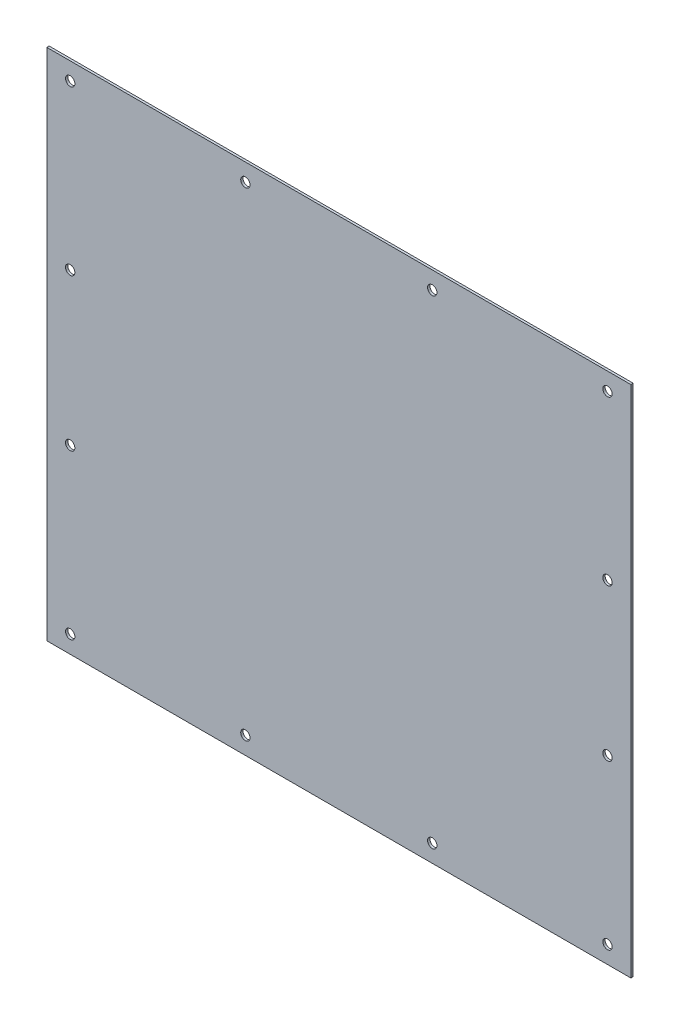
ISO-10303-21;
HEADER;
FILE_DESCRIPTION(('STEP AP214'),'2;1');
FILE_NAME('part.step','',(''),(''),'','','');
FILE_SCHEMA(('AUTOMOTIVE_DESIGN { 1 0 10303 214 1 1 1 1 }'));
ENDSEC;
DATA;
#1=APPLICATION_CONTEXT('core data for automotive mechanical design processes');
#2=APPLICATION_PROTOCOL_DEFINITION('international standard','automotive_design',2000,#1);
#3=PRODUCT_CONTEXT('',#1,'mechanical');
#4=PRODUCT('Part','Part','',(#3));
#5=PRODUCT_RELATED_PRODUCT_CATEGORY('part','',(#4));
#6=PRODUCT_DEFINITION_FORMATION('','',#4);
#7=PRODUCT_DEFINITION_CONTEXT('part definition',#1,'design');
#8=PRODUCT_DEFINITION('design','',#6,#7);
#9=PRODUCT_DEFINITION_SHAPE('','',#8);
#10=(LENGTH_UNIT() NAMED_UNIT(*) SI_UNIT(.MILLI.,.METRE.));
#11=(NAMED_UNIT(*) PLANE_ANGLE_UNIT() SI_UNIT($,.RADIAN.));
#12=(NAMED_UNIT(*) SI_UNIT($,.STERADIAN.) SOLID_ANGLE_UNIT());
#13=UNCERTAINTY_MEASURE_WITH_UNIT(LENGTH_MEASURE(1.E-05),#10,'distance_accuracy_value','');
#14=(GEOMETRIC_REPRESENTATION_CONTEXT(3) GLOBAL_UNCERTAINTY_ASSIGNED_CONTEXT((#13)) GLOBAL_UNIT_ASSIGNED_CONTEXT((#10,
#11,#12)) REPRESENTATION_CONTEXT('',''));
#15=CARTESIAN_POINT('',(0.,0.,0.));
#16=DIRECTION('',(0.,0.,1.));
#17=DIRECTION('',(1.,0.,0.));
#18=AXIS2_PLACEMENT_3D('',#15,#16,#17);
#19=CARTESIAN_POINT('',(-250.,0.,2.));
#20=DIRECTION('',(1.,0.,0.));
#21=DIRECTION('',(0.,1.,0.));
#22=AXIS2_PLACEMENT_3D('',#19,#20,#21);
#23=PLANE('',#22);
#24=DIRECTION('',(0.,-1.,0.));
#25=VECTOR('',#24,1.);
#26=CARTESIAN_POINT('',(-250.,0.,0.));
#27=LINE('',#26,#25);
#28=CARTESIAN_POINT('',(-250.,0.,0.));
#29=VERTEX_POINT('',#28);
#30=CARTESIAN_POINT('',(-250.,-440.,0.));
#31=VERTEX_POINT('',#30);
#32=EDGE_CURVE('E98',#29,#31,#27,.T.);
#33=ORIENTED_EDGE('',*,*,#32,.T.);
#34=DIRECTION('',(0.,0.,-1.));
#35=VECTOR('',#34,1.);
#36=CARTESIAN_POINT('',(-250.,-440.,2.));
#37=LINE('',#36,#35);
#38=CARTESIAN_POINT('',(-250.,-440.,2.));
#39=VERTEX_POINT('',#38);
#40=EDGE_CURVE('E11',#39,#31,#37,.T.);
#41=ORIENTED_EDGE('',*,*,#40,.F.);
#42=DIRECTION('',(0.,-1.,0.));
#43=VECTOR('',#42,1.);
#44=CARTESIAN_POINT('',(-250.,0.,2.));
#45=LINE('',#44,#43);
#46=CARTESIAN_POINT('',(-250.,0.,2.));
#47=VERTEX_POINT('',#46);
#48=EDGE_CURVE('E86',#47,#39,#45,.T.);
#49=ORIENTED_EDGE('',*,*,#48,.F.);
#50=DIRECTION('',(0.,0.,-1.));
#51=VECTOR('',#50,1.);
#52=CARTESIAN_POINT('',(-250.,0.,2.));
#53=LINE('',#52,#51);
#54=EDGE_CURVE('E94',#47,#29,#53,.T.);
#55=ORIENTED_EDGE('',*,*,#54,.T.);
#56=EDGE_LOOP('',(#33,#41,#49,#55));
#57=FACE_BOUND('',#56,.T.);
#58=ADVANCED_FACE('F35',(#57),#23,.F.);
#59=CARTESIAN_POINT('',(-250.,-440.,2.));
#60=DIRECTION('',(0.,1.,0.));
#61=DIRECTION('',(0.,0.,1.));
#62=AXIS2_PLACEMENT_3D('',#59,#60,#61);
#63=PLANE('',#62);
#64=DIRECTION('',(1.,0.,0.));
#65=VECTOR('',#64,1.);
#66=CARTESIAN_POINT('',(-250.,-440.,0.));
#67=LINE('',#66,#65);
#68=CARTESIAN_POINT('',(250.,-440.,0.));
#69=VERTEX_POINT('',#68);
#70=EDGE_CURVE('E90',#31,#69,#67,.T.);
#71=ORIENTED_EDGE('',*,*,#70,.T.);
#72=DIRECTION('',(0.,0.,-1.));
#73=VECTOR('',#72,1.);
#74=CARTESIAN_POINT('',(250.,-440.,2.));
#75=LINE('',#74,#73);
#76=CARTESIAN_POINT('',(250.,-440.,2.));
#77=VERTEX_POINT('',#76);
#78=EDGE_CURVE('E43',#77,#69,#75,.T.);
#79=ORIENTED_EDGE('',*,*,#78,.F.);
#80=DIRECTION('',(1.,0.,0.));
#81=VECTOR('',#80,1.);
#82=CARTESIAN_POINT('',(-250.,-440.,2.));
#83=LINE('',#82,#81);
#84=EDGE_CURVE('E81',#39,#77,#83,.T.);
#85=ORIENTED_EDGE('',*,*,#84,.F.);
#86=ORIENTED_EDGE('',*,*,#40,.T.);
#87=EDGE_LOOP('',(#71,#79,#85,#86));
#88=FACE_BOUND('',#87,.T.);
#89=ADVANCED_FACE('F89',(#88),#63,.F.);
#90=CARTESIAN_POINT('',(250.,0.,2.));
#91=DIRECTION('',(-1.,0.,0.));
#92=DIRECTION('',(0.,-1.,0.));
#93=AXIS2_PLACEMENT_3D('',#90,#91,#92);
#94=PLANE('',#93);
#95=DIRECTION('',(0.,1.,0.));
#96=VECTOR('',#95,1.);
#97=CARTESIAN_POINT('',(250.,0.,0.));
#98=LINE('',#97,#96);
#99=CARTESIAN_POINT('',(250.,0.,0.));
#100=VERTEX_POINT('',#99);
#101=EDGE_CURVE('E68',#69,#100,#98,.T.);
#102=ORIENTED_EDGE('',*,*,#101,.T.);
#103=DIRECTION('',(0.,0.,-1.));
#104=VECTOR('',#103,1.);
#105=CARTESIAN_POINT('',(250.,0.,2.));
#106=LINE('',#105,#104);
#107=CARTESIAN_POINT('',(250.,0.,2.));
#108=VERTEX_POINT('',#107);
#109=EDGE_CURVE('E91',#108,#100,#106,.T.);
#110=ORIENTED_EDGE('',*,*,#109,.F.);
#111=DIRECTION('',(0.,1.,0.));
#112=VECTOR('',#111,1.);
#113=CARTESIAN_POINT('',(250.,0.,2.));
#114=LINE('',#113,#112);
#115=EDGE_CURVE('E84',#77,#108,#114,.T.);
#116=ORIENTED_EDGE('',*,*,#115,.F.);
#117=ORIENTED_EDGE('',*,*,#78,.T.);
#118=EDGE_LOOP('',(#102,#110,#116,#117));
#119=FACE_BOUND('',#118,.T.);
#120=ADVANCED_FACE('F92',(#119),#94,.F.);
#121=CARTESIAN_POINT('',(-250.,0.,2.));
#122=DIRECTION('',(0.,-1.,0.));
#123=DIRECTION('',(0.,0.,-1.));
#124=AXIS2_PLACEMENT_3D('',#121,#122,#123);
#125=PLANE('',#124);
#126=DIRECTION('',(-1.,0.,0.));
#127=VECTOR('',#126,1.);
#128=CARTESIAN_POINT('',(-250.,0.,0.));
#129=LINE('',#128,#127);
#130=EDGE_CURVE('E74',#100,#29,#129,.T.);
#131=ORIENTED_EDGE('',*,*,#130,.T.);
#132=ORIENTED_EDGE('',*,*,#54,.F.);
#133=DIRECTION('',(-1.,0.,0.));
#134=VECTOR('',#133,1.);
#135=CARTESIAN_POINT('',(-250.,0.,2.));
#136=LINE('',#135,#134);
#137=EDGE_CURVE('E51',#108,#47,#136,.T.);
#138=ORIENTED_EDGE('',*,*,#137,.F.);
#139=ORIENTED_EDGE('',*,*,#109,.T.);
#140=EDGE_LOOP('',(#131,#132,#138,#139));
#141=FACE_BOUND('',#140,.T.);
#142=ADVANCED_FACE('F106',(#141),#125,.F.);
#143=CARTESIAN_POINT('',(0.,0.,2.));
#144=DIRECTION('',(0.,0.,1.));
#145=DIRECTION('',(1.,0.,0.));
#146=AXIS2_PLACEMENT_3D('',#143,#144,#145);
#147=PLANE('',#146);
#148=CARTESIAN_POINT('',(-230.,-425.,2.));
#149=DIRECTION('',(0.,0.,1.));
#150=DIRECTION('',(1.,0.,0.));
#151=AXIS2_PLACEMENT_3D('',#148,#149,#150);
#152=CIRCLE('',#151,4.00000000000002);
#153=CARTESIAN_POINT('',(-226.,-425.,2.));
#154=VERTEX_POINT('',#153);
#155=EDGE_CURVE('E177',#154,#154,#152,.T.);
#156=ORIENTED_EDGE('',*,*,#155,.F.);
#157=EDGE_LOOP('',(#156));
#158=FACE_BOUND('',#157,.T.);
#159=CARTESIAN_POINT('',(230.,-155.,2.));
#160=DIRECTION('',(0.,0.,1.));
#161=DIRECTION('',(1.,0.,0.));
#162=AXIS2_PLACEMENT_3D('',#159,#160,#161);
#163=CIRCLE('',#162,3.99999999999999);
#164=CARTESIAN_POINT('',(234.,-155.,2.));
#165=VERTEX_POINT('',#164);
#166=EDGE_CURVE('E171',#165,#165,#163,.T.);
#167=ORIENTED_EDGE('',*,*,#166,.F.);
#168=EDGE_LOOP('',(#167));
#169=FACE_BOUND('',#168,.T.);
#170=CARTESIAN_POINT('',(230.,-285.,2.));
#171=DIRECTION('',(0.,0.,1.));
#172=DIRECTION('',(1.,0.,0.));
#173=AXIS2_PLACEMENT_3D('',#170,#171,#172);
#174=CIRCLE('',#173,3.99999999999999);
#175=CARTESIAN_POINT('',(234.,-285.,2.));
#176=VERTEX_POINT('',#175);
#177=EDGE_CURVE('E165',#176,#176,#174,.T.);
#178=ORIENTED_EDGE('',*,*,#177,.F.);
#179=EDGE_LOOP('',(#178));
#180=FACE_BOUND('',#179,.T.);
#181=CARTESIAN_POINT('',(230.,-425.,2.));
#182=DIRECTION('',(0.,0.,1.));
#183=DIRECTION('',(1.,0.,0.));
#184=AXIS2_PLACEMENT_3D('',#181,#182,#183);
#185=CIRCLE('',#184,3.99999999999999);
#186=CARTESIAN_POINT('',(234.,-425.,2.));
#187=VERTEX_POINT('',#186);
#188=EDGE_CURVE('E159',#187,#187,#185,.T.);
#189=ORIENTED_EDGE('',*,*,#188,.F.);
#190=EDGE_LOOP('',(#189));
#191=FACE_BOUND('',#190,.T.);
#192=CARTESIAN_POINT('',(79.9999999999999,-425.,2.));
#193=DIRECTION('',(0.,0.,1.));
#194=DIRECTION('',(1.,0.,0.));
#195=AXIS2_PLACEMENT_3D('',#192,#193,#194);
#196=CIRCLE('',#195,4.00000000000001);
#197=CARTESIAN_POINT('',(83.9999999999999,-425.,2.));
#198=VERTEX_POINT('',#197);
#199=EDGE_CURVE('E153',#198,#198,#196,.T.);
#200=ORIENTED_EDGE('',*,*,#199,.F.);
#201=EDGE_LOOP('',(#200));
#202=FACE_BOUND('',#201,.T.);
#203=CARTESIAN_POINT('',(-80.0000000000001,-425.,2.));
#204=DIRECTION('',(0.,0.,1.));
#205=DIRECTION('',(1.,0.,0.));
#206=AXIS2_PLACEMENT_3D('',#203,#204,#205);
#207=CIRCLE('',#206,4.00000000000001);
#208=CARTESIAN_POINT('',(-76.0000000000001,-425.,2.));
#209=VERTEX_POINT('',#208);
#210=EDGE_CURVE('E147',#209,#209,#207,.T.);
#211=ORIENTED_EDGE('',*,*,#210,.F.);
#212=EDGE_LOOP('',(#211));
#213=FACE_BOUND('',#212,.T.);
#214=CARTESIAN_POINT('',(-230.,-285.,2.));
#215=DIRECTION('',(0.,0.,1.));
#216=DIRECTION('',(1.,0.,0.));
#217=AXIS2_PLACEMENT_3D('',#214,#215,#216);
#218=CIRCLE('',#217,3.99999999999999);
#219=CARTESIAN_POINT('',(-226.,-285.,2.));
#220=VERTEX_POINT('',#219);
#221=EDGE_CURVE('E141',#220,#220,#218,.T.);
#222=ORIENTED_EDGE('',*,*,#221,.F.);
#223=EDGE_LOOP('',(#222));
#224=FACE_BOUND('',#223,.T.);
#225=CARTESIAN_POINT('',(-230.,-155.,2.));
#226=DIRECTION('',(0.,0.,1.));
#227=DIRECTION('',(1.,0.,0.));
#228=AXIS2_PLACEMENT_3D('',#225,#226,#227);
#229=CIRCLE('',#228,4.00000000000002);
#230=CARTESIAN_POINT('',(-226.,-155.,2.));
#231=VERTEX_POINT('',#230);
#232=EDGE_CURVE('E135',#231,#231,#229,.T.);
#233=ORIENTED_EDGE('',*,*,#232,.F.);
#234=EDGE_LOOP('',(#233));
#235=FACE_BOUND('',#234,.T.);
#236=CARTESIAN_POINT('',(-230.,-15.,2.));
#237=DIRECTION('',(0.,0.,1.));
#238=DIRECTION('',(1.,0.,0.));
#239=AXIS2_PLACEMENT_3D('',#236,#237,#238);
#240=CIRCLE('',#239,3.99999999999999);
#241=CARTESIAN_POINT('',(-226.,-15.,2.));
#242=VERTEX_POINT('',#241);
#243=EDGE_CURVE('E129',#242,#242,#240,.T.);
#244=ORIENTED_EDGE('',*,*,#243,.F.);
#245=EDGE_LOOP('',(#244));
#246=FACE_BOUND('',#245,.T.);
#247=CARTESIAN_POINT('',(-80.,-15.,2.));
#248=DIRECTION('',(0.,0.,1.));
#249=DIRECTION('',(1.,0.,0.));
#250=AXIS2_PLACEMENT_3D('',#247,#248,#249);
#251=CIRCLE('',#250,4.00000000000001);
#252=CARTESIAN_POINT('',(-76.,-15.,2.));
#253=VERTEX_POINT('',#252);
#254=EDGE_CURVE('E123',#253,#253,#251,.T.);
#255=ORIENTED_EDGE('',*,*,#254,.F.);
#256=EDGE_LOOP('',(#255));
#257=FACE_BOUND('',#256,.T.);
#258=CARTESIAN_POINT('',(80.,-15.,2.));
#259=DIRECTION('',(0.,0.,1.));
#260=DIRECTION('',(1.,0.,0.));
#261=AXIS2_PLACEMENT_3D('',#258,#259,#260);
#262=CIRCLE('',#261,4.00000000000001);
#263=CARTESIAN_POINT('',(84.,-15.,2.));
#264=VERTEX_POINT('',#263);
#265=EDGE_CURVE('E117',#264,#264,#262,.T.);
#266=ORIENTED_EDGE('',*,*,#265,.F.);
#267=EDGE_LOOP('',(#266));
#268=FACE_BOUND('',#267,.T.);
#269=CARTESIAN_POINT('',(230.,-15.,2.));
#270=DIRECTION('',(0.,0.,1.));
#271=DIRECTION('',(1.,0.,0.));
#272=AXIS2_PLACEMENT_3D('',#269,#270,#271);
#273=CIRCLE('',#272,3.99999999999999);
#274=CARTESIAN_POINT('',(234.,-15.,2.));
#275=VERTEX_POINT('',#274);
#276=EDGE_CURVE('E101',#275,#275,#273,.T.);
#277=ORIENTED_EDGE('',*,*,#276,.F.);
#278=EDGE_LOOP('',(#277));
#279=FACE_BOUND('',#278,.T.);
#280=ORIENTED_EDGE('',*,*,#48,.T.);
#281=ORIENTED_EDGE('',*,*,#84,.T.);
#282=ORIENTED_EDGE('',*,*,#115,.T.);
#283=ORIENTED_EDGE('',*,*,#137,.T.);
#284=EDGE_LOOP('',(#280,#281,#282,#283));
#285=FACE_BOUND('',#284,.T.);
#286=ADVANCED_FACE('F82',(#158,#169,#180,#191,#202,#213,#224,#235,#246,#257,#268,#279,#285),
#147,.T.);
#287=CARTESIAN_POINT('',(0.,0.,0.));
#288=DIRECTION('',(0.,0.,1.));
#289=DIRECTION('',(1.,0.,0.));
#290=AXIS2_PLACEMENT_3D('',#287,#288,#289);
#291=PLANE('',#290);
#292=CARTESIAN_POINT('',(-230.,-425.,0.));
#293=DIRECTION('',(0.,0.,-1.));
#294=DIRECTION('',(-1.,0.,0.));
#295=AXIS2_PLACEMENT_3D('',#292,#293,#294);
#296=CIRCLE('',#295,4.00000000000002);
#297=CARTESIAN_POINT('',(-234.,-425.,0.));
#298=VERTEX_POINT('',#297);
#299=EDGE_CURVE('E180',#298,#298,#296,.T.);
#300=ORIENTED_EDGE('',*,*,#299,.F.);
#301=EDGE_LOOP('',(#300));
#302=FACE_BOUND('',#301,.T.);
#303=CARTESIAN_POINT('',(230.,-155.,0.));
#304=DIRECTION('',(0.,0.,-1.));
#305=DIRECTION('',(-1.,0.,0.));
#306=AXIS2_PLACEMENT_3D('',#303,#304,#305);
#307=CIRCLE('',#306,3.99999999999999);
#308=CARTESIAN_POINT('',(226.,-155.,0.));
#309=VERTEX_POINT('',#308);
#310=EDGE_CURVE('E174',#309,#309,#307,.T.);
#311=ORIENTED_EDGE('',*,*,#310,.F.);
#312=EDGE_LOOP('',(#311));
#313=FACE_BOUND('',#312,.T.);
#314=CARTESIAN_POINT('',(230.,-285.,0.));
#315=DIRECTION('',(0.,0.,-1.));
#316=DIRECTION('',(-1.,0.,0.));
#317=AXIS2_PLACEMENT_3D('',#314,#315,#316);
#318=CIRCLE('',#317,3.99999999999999);
#319=CARTESIAN_POINT('',(226.,-285.,0.));
#320=VERTEX_POINT('',#319);
#321=EDGE_CURVE('E168',#320,#320,#318,.T.);
#322=ORIENTED_EDGE('',*,*,#321,.F.);
#323=EDGE_LOOP('',(#322));
#324=FACE_BOUND('',#323,.T.);
#325=CARTESIAN_POINT('',(230.,-425.,0.));
#326=DIRECTION('',(0.,0.,-1.));
#327=DIRECTION('',(-1.,0.,0.));
#328=AXIS2_PLACEMENT_3D('',#325,#326,#327);
#329=CIRCLE('',#328,3.99999999999999);
#330=CARTESIAN_POINT('',(226.,-425.,0.));
#331=VERTEX_POINT('',#330);
#332=EDGE_CURVE('E162',#331,#331,#329,.T.);
#333=ORIENTED_EDGE('',*,*,#332,.F.);
#334=EDGE_LOOP('',(#333));
#335=FACE_BOUND('',#334,.T.);
#336=CARTESIAN_POINT('',(79.9999999999999,-425.,0.));
#337=DIRECTION('',(0.,0.,-1.));
#338=DIRECTION('',(-1.,0.,0.));
#339=AXIS2_PLACEMENT_3D('',#336,#337,#338);
#340=CIRCLE('',#339,4.00000000000001);
#341=CARTESIAN_POINT('',(75.9999999999999,-425.,0.));
#342=VERTEX_POINT('',#341);
#343=EDGE_CURVE('E156',#342,#342,#340,.T.);
#344=ORIENTED_EDGE('',*,*,#343,.F.);
#345=EDGE_LOOP('',(#344));
#346=FACE_BOUND('',#345,.T.);
#347=CARTESIAN_POINT('',(-80.0000000000001,-425.,0.));
#348=DIRECTION('',(0.,0.,-1.));
#349=DIRECTION('',(-1.,0.,0.));
#350=AXIS2_PLACEMENT_3D('',#347,#348,#349);
#351=CIRCLE('',#350,4.00000000000001);
#352=CARTESIAN_POINT('',(-84.0000000000001,-425.,0.));
#353=VERTEX_POINT('',#352);
#354=EDGE_CURVE('E150',#353,#353,#351,.T.);
#355=ORIENTED_EDGE('',*,*,#354,.F.);
#356=EDGE_LOOP('',(#355));
#357=FACE_BOUND('',#356,.T.);
#358=CARTESIAN_POINT('',(-230.,-285.,0.));
#359=DIRECTION('',(0.,0.,-1.));
#360=DIRECTION('',(-1.,0.,0.));
#361=AXIS2_PLACEMENT_3D('',#358,#359,#360);
#362=CIRCLE('',#361,3.99999999999999);
#363=CARTESIAN_POINT('',(-234.,-285.,0.));
#364=VERTEX_POINT('',#363);
#365=EDGE_CURVE('E144',#364,#364,#362,.T.);
#366=ORIENTED_EDGE('',*,*,#365,.F.);
#367=EDGE_LOOP('',(#366));
#368=FACE_BOUND('',#367,.T.);
#369=CARTESIAN_POINT('',(-230.,-155.,0.));
#370=DIRECTION('',(0.,0.,-1.));
#371=DIRECTION('',(-1.,0.,0.));
#372=AXIS2_PLACEMENT_3D('',#369,#370,#371);
#373=CIRCLE('',#372,4.00000000000002);
#374=CARTESIAN_POINT('',(-234.,-155.,0.));
#375=VERTEX_POINT('',#374);
#376=EDGE_CURVE('E138',#375,#375,#373,.T.);
#377=ORIENTED_EDGE('',*,*,#376,.F.);
#378=EDGE_LOOP('',(#377));
#379=FACE_BOUND('',#378,.T.);
#380=CARTESIAN_POINT('',(-230.,-15.,0.));
#381=DIRECTION('',(0.,0.,-1.));
#382=DIRECTION('',(-1.,0.,0.));
#383=AXIS2_PLACEMENT_3D('',#380,#381,#382);
#384=CIRCLE('',#383,3.99999999999999);
#385=CARTESIAN_POINT('',(-234.,-15.,0.));
#386=VERTEX_POINT('',#385);
#387=EDGE_CURVE('E132',#386,#386,#384,.T.);
#388=ORIENTED_EDGE('',*,*,#387,.F.);
#389=EDGE_LOOP('',(#388));
#390=FACE_BOUND('',#389,.T.);
#391=CARTESIAN_POINT('',(-80.,-15.,0.));
#392=DIRECTION('',(0.,0.,-1.));
#393=DIRECTION('',(-1.,0.,0.));
#394=AXIS2_PLACEMENT_3D('',#391,#392,#393);
#395=CIRCLE('',#394,4.00000000000001);
#396=CARTESIAN_POINT('',(-84.,-15.,0.));
#397=VERTEX_POINT('',#396);
#398=EDGE_CURVE('E126',#397,#397,#395,.T.);
#399=ORIENTED_EDGE('',*,*,#398,.F.);
#400=EDGE_LOOP('',(#399));
#401=FACE_BOUND('',#400,.T.);
#402=CARTESIAN_POINT('',(80.,-15.,0.));
#403=DIRECTION('',(0.,0.,-1.));
#404=DIRECTION('',(-1.,0.,0.));
#405=AXIS2_PLACEMENT_3D('',#402,#403,#404);
#406=CIRCLE('',#405,4.00000000000001);
#407=CARTESIAN_POINT('',(76.,-15.,0.));
#408=VERTEX_POINT('',#407);
#409=EDGE_CURVE('E120',#408,#408,#406,.T.);
#410=ORIENTED_EDGE('',*,*,#409,.F.);
#411=EDGE_LOOP('',(#410));
#412=FACE_BOUND('',#411,.T.);
#413=CARTESIAN_POINT('',(230.,-15.,0.));
#414=DIRECTION('',(0.,0.,-1.));
#415=DIRECTION('',(-1.,0.,0.));
#416=AXIS2_PLACEMENT_3D('',#413,#414,#415);
#417=CIRCLE('',#416,3.99999999999999);
#418=CARTESIAN_POINT('',(226.,-15.,0.));
#419=VERTEX_POINT('',#418);
#420=EDGE_CURVE('E114',#419,#419,#417,.T.);
#421=ORIENTED_EDGE('',*,*,#420,.F.);
#422=EDGE_LOOP('',(#421));
#423=FACE_BOUND('',#422,.T.);
#424=ORIENTED_EDGE('',*,*,#32,.F.);
#425=ORIENTED_EDGE('',*,*,#130,.F.);
#426=ORIENTED_EDGE('',*,*,#101,.F.);
#427=ORIENTED_EDGE('',*,*,#70,.F.);
#428=EDGE_LOOP('',(#424,#425,#426,#427));
#429=FACE_BOUND('',#428,.T.);
#430=ADVANCED_FACE('F109',(#302,#313,#324,#335,#346,#357,#368,#379,#390,#401,#412,#423,#429),
#291,.F.);
#431=CARTESIAN_POINT('',(230.,-15.,10.));
#432=DIRECTION('',(0.,0.,-1.));
#433=DIRECTION('',(-1.,0.,0.));
#434=AXIS2_PLACEMENT_3D('',#431,#432,#433);
#435=CYLINDRICAL_SURFACE('',#434,3.99999999999999);
#436=ORIENTED_EDGE('',*,*,#276,.T.);
#437=EDGE_LOOP('',(#436));
#438=FACE_BOUND('',#437,.T.);
#439=ORIENTED_EDGE('',*,*,#420,.T.);
#440=EDGE_LOOP('',(#439));
#441=FACE_BOUND('',#440,.T.);
#442=ADVANCED_FACE('F188',(#438,#441),#435,.F.);
#443=CARTESIAN_POINT('',(80.,-15.,10.));
#444=DIRECTION('',(0.,0.,-1.));
#445=DIRECTION('',(-1.,0.,0.));
#446=AXIS2_PLACEMENT_3D('',#443,#444,#445);
#447=CYLINDRICAL_SURFACE('',#446,4.00000000000001);
#448=ORIENTED_EDGE('',*,*,#265,.T.);
#449=EDGE_LOOP('',(#448));
#450=FACE_BOUND('',#449,.T.);
#451=ORIENTED_EDGE('',*,*,#409,.T.);
#452=EDGE_LOOP('',(#451));
#453=FACE_BOUND('',#452,.T.);
#454=ADVANCED_FACE('F213',(#450,#453),#447,.F.);
#455=CARTESIAN_POINT('',(-80.,-15.,10.));
#456=DIRECTION('',(0.,0.,-1.));
#457=DIRECTION('',(-1.,0.,0.));
#458=AXIS2_PLACEMENT_3D('',#455,#456,#457);
#459=CYLINDRICAL_SURFACE('',#458,4.00000000000001);
#460=ORIENTED_EDGE('',*,*,#254,.T.);
#461=EDGE_LOOP('',(#460));
#462=FACE_BOUND('',#461,.T.);
#463=ORIENTED_EDGE('',*,*,#398,.T.);
#464=EDGE_LOOP('',(#463));
#465=FACE_BOUND('',#464,.T.);
#466=ADVANCED_FACE('F219',(#462,#465),#459,.F.);
#467=CARTESIAN_POINT('',(-230.,-15.,10.));
#468=DIRECTION('',(0.,0.,-1.));
#469=DIRECTION('',(-1.,0.,0.));
#470=AXIS2_PLACEMENT_3D('',#467,#468,#469);
#471=CYLINDRICAL_SURFACE('',#470,3.99999999999999);
#472=ORIENTED_EDGE('',*,*,#243,.T.);
#473=EDGE_LOOP('',(#472));
#474=FACE_BOUND('',#473,.T.);
#475=ORIENTED_EDGE('',*,*,#387,.T.);
#476=EDGE_LOOP('',(#475));
#477=FACE_BOUND('',#476,.T.);
#478=ADVANCED_FACE('F264',(#474,#477),#471,.F.);
#479=CARTESIAN_POINT('',(-230.,-155.,10.));
#480=DIRECTION('',(0.,0.,-1.));
#481=DIRECTION('',(-1.,0.,0.));
#482=AXIS2_PLACEMENT_3D('',#479,#480,#481);
#483=CYLINDRICAL_SURFACE('',#482,4.00000000000002);
#484=ORIENTED_EDGE('',*,*,#232,.T.);
#485=EDGE_LOOP('',(#484));
#486=FACE_BOUND('',#485,.T.);
#487=ORIENTED_EDGE('',*,*,#376,.T.);
#488=EDGE_LOOP('',(#487));
#489=FACE_BOUND('',#488,.T.);
#490=ADVANCED_FACE('F269',(#486,#489),#483,.F.);
#491=CARTESIAN_POINT('',(-230.,-285.,10.));
#492=DIRECTION('',(0.,0.,-1.));
#493=DIRECTION('',(-1.,0.,0.));
#494=AXIS2_PLACEMENT_3D('',#491,#492,#493);
#495=CYLINDRICAL_SURFACE('',#494,3.99999999999999);
#496=ORIENTED_EDGE('',*,*,#221,.T.);
#497=EDGE_LOOP('',(#496));
#498=FACE_BOUND('',#497,.T.);
#499=ORIENTED_EDGE('',*,*,#365,.T.);
#500=EDGE_LOOP('',(#499));
#501=FACE_BOUND('',#500,.T.);
#502=ADVANCED_FACE('F275',(#498,#501),#495,.F.);
#503=CARTESIAN_POINT('',(-80.0000000000001,-425.,10.));
#504=DIRECTION('',(0.,0.,-1.));
#505=DIRECTION('',(-1.,0.,0.));
#506=AXIS2_PLACEMENT_3D('',#503,#504,#505);
#507=CYLINDRICAL_SURFACE('',#506,4.00000000000001);
#508=ORIENTED_EDGE('',*,*,#210,.T.);
#509=EDGE_LOOP('',(#508));
#510=FACE_BOUND('',#509,.T.);
#511=ORIENTED_EDGE('',*,*,#354,.T.);
#512=EDGE_LOOP('',(#511));
#513=FACE_BOUND('',#512,.T.);
#514=ADVANCED_FACE('F279',(#510,#513),#507,.F.);
#515=CARTESIAN_POINT('',(79.9999999999999,-425.,10.));
#516=DIRECTION('',(0.,0.,-1.));
#517=DIRECTION('',(-1.,0.,0.));
#518=AXIS2_PLACEMENT_3D('',#515,#516,#517);
#519=CYLINDRICAL_SURFACE('',#518,4.00000000000001);
#520=ORIENTED_EDGE('',*,*,#199,.T.);
#521=EDGE_LOOP('',(#520));
#522=FACE_BOUND('',#521,.T.);
#523=ORIENTED_EDGE('',*,*,#343,.T.);
#524=EDGE_LOOP('',(#523));
#525=FACE_BOUND('',#524,.T.);
#526=ADVANCED_FACE('F283',(#522,#525),#519,.F.);
#527=CARTESIAN_POINT('',(230.,-425.,10.));
#528=DIRECTION('',(0.,0.,-1.));
#529=DIRECTION('',(-1.,0.,0.));
#530=AXIS2_PLACEMENT_3D('',#527,#528,#529);
#531=CYLINDRICAL_SURFACE('',#530,3.99999999999999);
#532=ORIENTED_EDGE('',*,*,#188,.T.);
#533=EDGE_LOOP('',(#532));
#534=FACE_BOUND('',#533,.T.);
#535=ORIENTED_EDGE('',*,*,#332,.T.);
#536=EDGE_LOOP('',(#535));
#537=FACE_BOUND('',#536,.T.);
#538=ADVANCED_FACE('F287',(#534,#537),#531,.F.);
#539=CARTESIAN_POINT('',(230.,-285.,10.));
#540=DIRECTION('',(0.,0.,-1.));
#541=DIRECTION('',(-1.,0.,0.));
#542=AXIS2_PLACEMENT_3D('',#539,#540,#541);
#543=CYLINDRICAL_SURFACE('',#542,3.99999999999999);
#544=ORIENTED_EDGE('',*,*,#177,.T.);
#545=EDGE_LOOP('',(#544));
#546=FACE_BOUND('',#545,.T.);
#547=ORIENTED_EDGE('',*,*,#321,.T.);
#548=EDGE_LOOP('',(#547));
#549=FACE_BOUND('',#548,.T.);
#550=ADVANCED_FACE('F291',(#546,#549),#543,.F.);
#551=CARTESIAN_POINT('',(230.,-155.,10.));
#552=DIRECTION('',(0.,0.,-1.));
#553=DIRECTION('',(-1.,0.,0.));
#554=AXIS2_PLACEMENT_3D('',#551,#552,#553);
#555=CYLINDRICAL_SURFACE('',#554,3.99999999999999);
#556=ORIENTED_EDGE('',*,*,#166,.T.);
#557=EDGE_LOOP('',(#556));
#558=FACE_BOUND('',#557,.T.);
#559=ORIENTED_EDGE('',*,*,#310,.T.);
#560=EDGE_LOOP('',(#559));
#561=FACE_BOUND('',#560,.T.);
#562=ADVANCED_FACE('F295',(#558,#561),#555,.F.);
#563=CARTESIAN_POINT('',(-230.,-425.,10.));
#564=DIRECTION('',(0.,0.,-1.));
#565=DIRECTION('',(-1.,0.,0.));
#566=AXIS2_PLACEMENT_3D('',#563,#564,#565);
#567=CYLINDRICAL_SURFACE('',#566,4.00000000000002);
#568=ORIENTED_EDGE('',*,*,#155,.T.);
#569=EDGE_LOOP('',(#568));
#570=FACE_BOUND('',#569,.T.);
#571=ORIENTED_EDGE('',*,*,#299,.T.);
#572=EDGE_LOOP('',(#571));
#573=FACE_BOUND('',#572,.T.);
#574=ADVANCED_FACE('F184',(#570,#573),#567,.F.);
#575=CLOSED_SHELL('',(#58,#89,#120,#142,#286,#430,#442,#454,#466,#478,#490,#502,#514,#526,#538,
#550,#562,#574));
#576=MANIFOLD_SOLID_BREP('B2',#575);
#577=ADVANCED_BREP_SHAPE_REPRESENTATION('',(#18,#576),#14);
#578=SHAPE_DEFINITION_REPRESENTATION(#9,#577);
ENDSEC;
END-ISO-10303-21;
